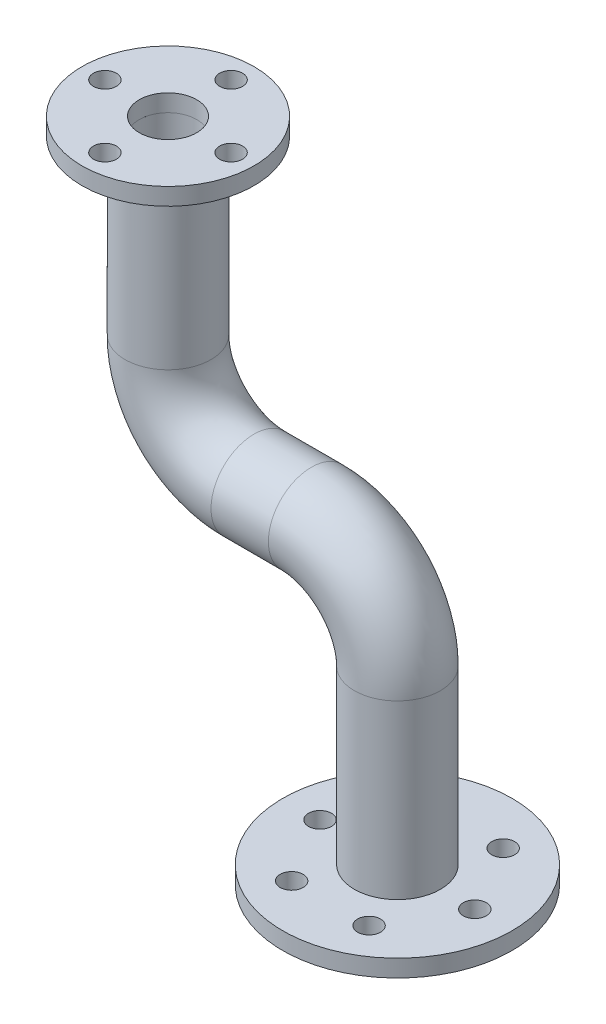
ISO-10303-21;
HEADER;
FILE_DESCRIPTION(('STEP AP214'),'2;1');
FILE_NAME('part.step','',(''),(''),'','','');
FILE_SCHEMA(('AUTOMOTIVE_DESIGN { 1 0 10303 214 1 1 1 1 }'));
ENDSEC;
DATA;
#1=APPLICATION_CONTEXT('core data for automotive mechanical design processes');
#2=APPLICATION_PROTOCOL_DEFINITION('international standard','automotive_design',2000,#1);
#3=PRODUCT_CONTEXT('',#1,'mechanical');
#4=PRODUCT('Part','Part','',(#3));
#5=PRODUCT_RELATED_PRODUCT_CATEGORY('part','',(#4));
#6=PRODUCT_DEFINITION_FORMATION('','',#4);
#7=PRODUCT_DEFINITION_CONTEXT('part definition',#1,'design');
#8=PRODUCT_DEFINITION('design','',#6,#7);
#9=PRODUCT_DEFINITION_SHAPE('','',#8);
#10=(LENGTH_UNIT() NAMED_UNIT(*) SI_UNIT(.MILLI.,.METRE.));
#11=(NAMED_UNIT(*) PLANE_ANGLE_UNIT() SI_UNIT($,.RADIAN.));
#12=(NAMED_UNIT(*) SI_UNIT($,.STERADIAN.) SOLID_ANGLE_UNIT());
#13=UNCERTAINTY_MEASURE_WITH_UNIT(LENGTH_MEASURE(1.E-05),#10,'distance_accuracy_value','');
#14=(GEOMETRIC_REPRESENTATION_CONTEXT(3) GLOBAL_UNCERTAINTY_ASSIGNED_CONTEXT((#13)) GLOBAL_UNIT_ASSIGNED_CONTEXT((#10,
#11,#12)) REPRESENTATION_CONTEXT('',''));
#15=CARTESIAN_POINT('',(0.,0.,0.));
#16=DIRECTION('',(0.,0.,1.));
#17=DIRECTION('',(1.,0.,0.));
#18=AXIS2_PLACEMENT_3D('',#15,#16,#17);
#19=CARTESIAN_POINT('',(100.,-240.,0.));
#20=DIRECTION('',(0.,-1.,0.));
#21=DIRECTION('',(0.,0.,-1.));
#22=AXIS2_PLACEMENT_3D('',#19,#20,#21);
#23=PLANE('',#22);
#24=CARTESIAN_POINT('',(66.2499999999993,-240.,58.4567147554493));
#25=DIRECTION('',(0.,-1.,0.));
#26=DIRECTION('',(-0.866025403784433,0.,-0.50000000000001));
#27=AXIS2_PLACEMENT_3D('',#24,#25,#26);
#28=CIRCLE('',#27,10.);
#29=CARTESIAN_POINT('',(57.5897459621549,-240.,53.4567147554492));
#30=VERTEX_POINT('',#29);
#31=EDGE_CURVE('E99',#30,#30,#28,.T.);
#32=ORIENTED_EDGE('',*,*,#31,.F.);
#33=EDGE_LOOP('',(#32));
#34=FACE_BOUND('',#33,.T.);
#35=CARTESIAN_POINT('',(133.749999999999,-240.,58.45671475545));
#36=DIRECTION('',(0.,-1.,0.));
#37=DIRECTION('',(-0.866025403784443,0.,0.499999999999992));
#38=AXIS2_PLACEMENT_3D('',#35,#36,#37);
#39=CIRCLE('',#38,10.);
#40=CARTESIAN_POINT('',(125.089745962155,-240.,63.4567147554499));
#41=VERTEX_POINT('',#40);
#42=EDGE_CURVE('E105',#41,#41,#39,.T.);
#43=ORIENTED_EDGE('',*,*,#42,.F.);
#44=EDGE_LOOP('',(#43));
#45=FACE_BOUND('',#44,.T.);
#46=CARTESIAN_POINT('',(167.5,-240.,0.));
#47=DIRECTION('',(0.,-1.,0.));
#48=DIRECTION('',(0.,0.,1.));
#49=AXIS2_PLACEMENT_3D('',#46,#47,#48);
#50=CIRCLE('',#49,10.);
#51=CARTESIAN_POINT('',(167.5,-240.,10.));
#52=VERTEX_POINT('',#51);
#53=EDGE_CURVE('E111',#52,#52,#50,.T.);
#54=ORIENTED_EDGE('',*,*,#53,.F.);
#55=EDGE_LOOP('',(#54));
#56=FACE_BOUND('',#55,.T.);
#57=CARTESIAN_POINT('',(133.75,-240.,-58.4567147554495));
#58=DIRECTION('',(0.,-1.,0.));
#59=DIRECTION('',(0.866025403784436,0.,0.500000000000004));
#60=AXIS2_PLACEMENT_3D('',#57,#58,#59);
#61=CIRCLE('',#60,10.);
#62=CARTESIAN_POINT('',(142.410254037845,-240.,-53.4567147554495));
#63=VERTEX_POINT('',#62);
#64=EDGE_CURVE('E117',#63,#63,#61,.T.);
#65=ORIENTED_EDGE('',*,*,#64,.F.);
#66=EDGE_LOOP('',(#65));
#67=FACE_BOUND('',#66,.T.);
#68=CARTESIAN_POINT('',(66.2500000000001,-240.,-58.4567147554497));
#69=DIRECTION('',(0.,-1.,0.));
#70=DIRECTION('',(0.86602540378444,0.,-0.499999999999998));
#71=AXIS2_PLACEMENT_3D('',#68,#69,#70);
#72=CIRCLE('',#71,10.);
#73=CARTESIAN_POINT('',(74.9102540378445,-240.,-63.4567147554497));
#74=VERTEX_POINT('',#73);
#75=EDGE_CURVE('E93',#74,#74,#72,.T.);
#76=ORIENTED_EDGE('',*,*,#75,.F.);
#77=EDGE_LOOP('',(#76));
#78=FACE_BOUND('',#77,.T.);
#79=CARTESIAN_POINT('',(32.4999999999999,-240.,0.));
#80=DIRECTION('',(0.,-1.,0.));
#81=DIRECTION('',(0.,0.,-1.));
#82=AXIS2_PLACEMENT_3D('',#79,#80,#81);
#83=CIRCLE('',#82,10.);
#84=CARTESIAN_POINT('',(32.4999999999999,-240.,-10.));
#85=VERTEX_POINT('',#84);
#86=EDGE_CURVE('E87',#85,#85,#83,.T.);
#87=ORIENTED_EDGE('',*,*,#86,.F.);
#88=EDGE_LOOP('',(#87));
#89=FACE_BOUND('',#88,.T.);
#90=CARTESIAN_POINT('',(100.,-240.,0.));
#91=DIRECTION('',(0.,-1.,0.));
#92=DIRECTION('',(0.,0.,-1.));
#93=AXIS2_PLACEMENT_3D('',#90,#91,#92);
#94=CIRCLE('',#93,100.);
#95=CARTESIAN_POINT('',(100.,-240.,-100.));
#96=VERTEX_POINT('',#95);
#97=EDGE_CURVE('E12',#96,#96,#94,.T.);
#98=ORIENTED_EDGE('',*,*,#97,.T.);
#99=EDGE_LOOP('',(#98));
#100=FACE_BOUND('',#99,.T.);
#101=CARTESIAN_POINT('',(100.,-240.,0.));
#102=DIRECTION('',(0.,-1.,0.));
#103=DIRECTION('',(0.,0.,-1.));
#104=AXIS2_PLACEMENT_3D('',#101,#102,#103);
#105=CIRCLE('',#104,25.);
#106=CARTESIAN_POINT('',(100.,-240.,-25.));
#107=VERTEX_POINT('',#106);
#108=EDGE_CURVE('E79',#107,#107,#105,.T.);
#109=ORIENTED_EDGE('',*,*,#108,.F.);
#110=EDGE_LOOP('',(#109));
#111=FACE_BOUND('',#110,.T.);
#112=ADVANCED_FACE('F68',(#34,#45,#56,#67,#78,#89,#100,#111),#23,.T.);
#113=CARTESIAN_POINT('',(100.,-225.,0.));
#114=DIRECTION('',(0.,-1.,0.));
#115=DIRECTION('',(0.,0.,-1.));
#116=AXIS2_PLACEMENT_3D('',#113,#114,#115);
#117=PLANE('',#116);
#118=CARTESIAN_POINT('',(66.2499999999993,-225.,58.4567147554493));
#119=DIRECTION('',(0.,-1.,0.));
#120=DIRECTION('',(-0.866025403784433,0.,-0.50000000000001));
#121=AXIS2_PLACEMENT_3D('',#118,#119,#120);
#122=CIRCLE('',#121,10.);
#123=CARTESIAN_POINT('',(57.5897459621549,-225.,53.4567147554492));
#124=VERTEX_POINT('',#123);
#125=EDGE_CURVE('E102',#124,#124,#122,.T.);
#126=ORIENTED_EDGE('',*,*,#125,.T.);
#127=EDGE_LOOP('',(#126));
#128=FACE_BOUND('',#127,.T.);
#129=CARTESIAN_POINT('',(133.749999999999,-225.,58.45671475545));
#130=DIRECTION('',(0.,-1.,0.));
#131=DIRECTION('',(-0.866025403784443,0.,0.499999999999992));
#132=AXIS2_PLACEMENT_3D('',#129,#130,#131);
#133=CIRCLE('',#132,10.);
#134=CARTESIAN_POINT('',(125.089745962155,-225.,63.4567147554499));
#135=VERTEX_POINT('',#134);
#136=EDGE_CURVE('E108',#135,#135,#133,.T.);
#137=ORIENTED_EDGE('',*,*,#136,.T.);
#138=EDGE_LOOP('',(#137));
#139=FACE_BOUND('',#138,.T.);
#140=CARTESIAN_POINT('',(167.5,-225.,0.));
#141=DIRECTION('',(0.,-1.,0.));
#142=DIRECTION('',(0.,0.,1.));
#143=AXIS2_PLACEMENT_3D('',#140,#141,#142);
#144=CIRCLE('',#143,10.);
#145=CARTESIAN_POINT('',(167.5,-225.,10.));
#146=VERTEX_POINT('',#145);
#147=EDGE_CURVE('E114',#146,#146,#144,.T.);
#148=ORIENTED_EDGE('',*,*,#147,.T.);
#149=EDGE_LOOP('',(#148));
#150=FACE_BOUND('',#149,.T.);
#151=CARTESIAN_POINT('',(133.75,-225.,-58.4567147554495));
#152=DIRECTION('',(0.,-1.,0.));
#153=DIRECTION('',(0.866025403784436,0.,0.500000000000004));
#154=AXIS2_PLACEMENT_3D('',#151,#152,#153);
#155=CIRCLE('',#154,10.);
#156=CARTESIAN_POINT('',(142.410254037845,-225.,-53.4567147554495));
#157=VERTEX_POINT('',#156);
#158=EDGE_CURVE('E96',#157,#157,#155,.T.);
#159=ORIENTED_EDGE('',*,*,#158,.T.);
#160=EDGE_LOOP('',(#159));
#161=FACE_BOUND('',#160,.T.);
#162=CARTESIAN_POINT('',(66.2500000000001,-225.,-58.4567147554497));
#163=DIRECTION('',(0.,-1.,0.));
#164=DIRECTION('',(0.86602540378444,0.,-0.499999999999998));
#165=AXIS2_PLACEMENT_3D('',#162,#163,#164);
#166=CIRCLE('',#165,10.);
#167=CARTESIAN_POINT('',(74.9102540378445,-225.,-63.4567147554497));
#168=VERTEX_POINT('',#167);
#169=EDGE_CURVE('E90',#168,#168,#166,.T.);
#170=ORIENTED_EDGE('',*,*,#169,.T.);
#171=EDGE_LOOP('',(#170));
#172=FACE_BOUND('',#171,.T.);
#173=CARTESIAN_POINT('',(32.4999999999999,-225.,0.));
#174=DIRECTION('',(0.,-1.,0.));
#175=DIRECTION('',(0.,0.,-1.));
#176=AXIS2_PLACEMENT_3D('',#173,#174,#175);
#177=CIRCLE('',#176,10.);
#178=CARTESIAN_POINT('',(32.4999999999999,-225.,-10.));
#179=VERTEX_POINT('',#178);
#180=EDGE_CURVE('E84',#179,#179,#177,.T.);
#181=ORIENTED_EDGE('',*,*,#180,.T.);
#182=EDGE_LOOP('',(#181));
#183=FACE_BOUND('',#182,.T.);
#184=CARTESIAN_POINT('',(100.,-225.,0.));
#185=DIRECTION('',(0.,-1.,0.));
#186=DIRECTION('',(0.,0.,-1.));
#187=AXIS2_PLACEMENT_3D('',#184,#185,#186);
#188=CIRCLE('',#187,100.);
#189=CARTESIAN_POINT('',(100.,-225.,-100.));
#190=VERTEX_POINT('',#189);
#191=EDGE_CURVE('E72',#190,#190,#188,.T.);
#192=ORIENTED_EDGE('',*,*,#191,.F.);
#193=EDGE_LOOP('',(#192));
#194=FACE_BOUND('',#193,.T.);
#195=CARTESIAN_POINT('',(100.,-225.,0.));
#196=DIRECTION('',(0.,-1.,0.));
#197=DIRECTION('',(0.,0.,-1.));
#198=AXIS2_PLACEMENT_3D('',#195,#196,#197);
#199=CIRCLE('',#198,25.);
#200=CARTESIAN_POINT('',(100.,-225.,-25.));
#201=VERTEX_POINT('',#200);
#202=EDGE_CURVE('E81',#201,#201,#199,.T.);
#203=ORIENTED_EDGE('',*,*,#202,.T.);
#204=EDGE_LOOP('',(#203));
#205=FACE_BOUND('',#204,.T.);
#206=ADVANCED_FACE('F123',(#128,#139,#150,#161,#172,#183,#194,#205),#117,.F.);
#207=CARTESIAN_POINT('',(100.,-240.,0.));
#208=DIRECTION('',(0.,1.,0.));
#209=DIRECTION('',(0.,0.,1.));
#210=AXIS2_PLACEMENT_3D('',#207,#208,#209);
#211=CYLINDRICAL_SURFACE('',#210,100.);
#212=ORIENTED_EDGE('',*,*,#97,.F.);
#213=EDGE_LOOP('',(#212));
#214=FACE_BOUND('',#213,.T.);
#215=ORIENTED_EDGE('',*,*,#191,.T.);
#216=EDGE_LOOP('',(#215));
#217=FACE_BOUND('',#216,.T.);
#218=ADVANCED_FACE('F70',(#214,#217),#211,.T.);
#219=CARTESIAN_POINT('',(100.,-240.,0.));
#220=DIRECTION('',(0.,1.,0.));
#221=DIRECTION('',(0.,0.,1.));
#222=AXIS2_PLACEMENT_3D('',#219,#220,#221);
#223=CYLINDRICAL_SURFACE('',#222,25.);
#224=ORIENTED_EDGE('',*,*,#108,.T.);
#225=EDGE_LOOP('',(#224));
#226=FACE_BOUND('',#225,.T.);
#227=ORIENTED_EDGE('',*,*,#202,.F.);
#228=EDGE_LOOP('',(#227));
#229=FACE_BOUND('',#228,.T.);
#230=ADVANCED_FACE('F144',(#226,#229),#223,.F.);
#231=CARTESIAN_POINT('',(32.4999999999999,-225.,0.));
#232=DIRECTION('',(0.,-1.,0.));
#233=DIRECTION('',(0.,0.,-1.));
#234=AXIS2_PLACEMENT_3D('',#231,#232,#233);
#235=CYLINDRICAL_SURFACE('',#234,10.);
#236=ORIENTED_EDGE('',*,*,#180,.F.);
#237=EDGE_LOOP('',(#236));
#238=FACE_BOUND('',#237,.T.);
#239=ORIENTED_EDGE('',*,*,#86,.T.);
#240=EDGE_LOOP('',(#239));
#241=FACE_BOUND('',#240,.T.);
#242=ADVANCED_FACE('F147',(#238,#241),#235,.F.);
#243=CARTESIAN_POINT('',(66.2500000000001,-225.,-58.4567147554497));
#244=DIRECTION('',(0.,-1.,0.));
#245=DIRECTION('',(0.,0.,-1.));
#246=AXIS2_PLACEMENT_3D('',#243,#244,#245);
#247=CYLINDRICAL_SURFACE('',#246,10.);
#248=ORIENTED_EDGE('',*,*,#169,.F.);
#249=EDGE_LOOP('',(#248));
#250=FACE_BOUND('',#249,.T.);
#251=ORIENTED_EDGE('',*,*,#75,.T.);
#252=EDGE_LOOP('',(#251));
#253=FACE_BOUND('',#252,.T.);
#254=ADVANCED_FACE('F130',(#250,#253),#247,.F.);
#255=CARTESIAN_POINT('',(133.75,-225.,-58.4567147554495));
#256=DIRECTION('',(0.,-1.,0.));
#257=DIRECTION('',(0.,0.,-1.));
#258=AXIS2_PLACEMENT_3D('',#255,#256,#257);
#259=CYLINDRICAL_SURFACE('',#258,10.);
#260=ORIENTED_EDGE('',*,*,#158,.F.);
#261=EDGE_LOOP('',(#260));
#262=FACE_BOUND('',#261,.T.);
#263=ORIENTED_EDGE('',*,*,#64,.T.);
#264=EDGE_LOOP('',(#263));
#265=FACE_BOUND('',#264,.T.);
#266=ADVANCED_FACE('F126',(#262,#265),#259,.F.);
#267=CARTESIAN_POINT('',(167.5,-225.,0.));
#268=DIRECTION('',(0.,-1.,0.));
#269=DIRECTION('',(0.,0.,-1.));
#270=AXIS2_PLACEMENT_3D('',#267,#268,#269);
#271=CYLINDRICAL_SURFACE('',#270,10.);
#272=ORIENTED_EDGE('',*,*,#147,.F.);
#273=EDGE_LOOP('',(#272));
#274=FACE_BOUND('',#273,.T.);
#275=ORIENTED_EDGE('',*,*,#53,.T.);
#276=EDGE_LOOP('',(#275));
#277=FACE_BOUND('',#276,.T.);
#278=ADVANCED_FACE('F129',(#274,#277),#271,.F.);
#279=CARTESIAN_POINT('',(133.749999999999,-225.,58.45671475545));
#280=DIRECTION('',(0.,-1.,0.));
#281=DIRECTION('',(0.,0.,-1.));
#282=AXIS2_PLACEMENT_3D('',#279,#280,#281);
#283=CYLINDRICAL_SURFACE('',#282,10.);
#284=ORIENTED_EDGE('',*,*,#136,.F.);
#285=EDGE_LOOP('',(#284));
#286=FACE_BOUND('',#285,.T.);
#287=ORIENTED_EDGE('',*,*,#42,.T.);
#288=EDGE_LOOP('',(#287));
#289=FACE_BOUND('',#288,.T.);
#290=ADVANCED_FACE('F168',(#286,#289),#283,.F.);
#291=CARTESIAN_POINT('',(66.2499999999993,-225.,58.4567147554493));
#292=DIRECTION('',(0.,-1.,0.));
#293=DIRECTION('',(0.,0.,-1.));
#294=AXIS2_PLACEMENT_3D('',#291,#292,#293);
#295=CYLINDRICAL_SURFACE('',#294,10.);
#296=ORIENTED_EDGE('',*,*,#125,.F.);
#297=EDGE_LOOP('',(#296));
#298=FACE_BOUND('',#297,.T.);
#299=ORIENTED_EDGE('',*,*,#31,.T.);
#300=EDGE_LOOP('',(#299));
#301=FACE_BOUND('',#300,.T.);
#302=ADVANCED_FACE('F165',(#298,#301),#295,.F.);
#303=CLOSED_SHELL('',(#112,#206,#218,#230,#242,#254,#266,#278,#290,#302));
#304=MANIFOLD_SOLID_BREP('B2',#303);
#305=CARTESIAN_POINT('',(-100.,240.,0.));
#306=DIRECTION('',(0.,1.,0.));
#307=DIRECTION('',(0.,0.,1.));
#308=AXIS2_PLACEMENT_3D('',#305,#306,#307);
#309=PLANE('',#308);
#310=CARTESIAN_POINT('',(-100.,240.,55.));
#311=DIRECTION('',(0.,1.,0.));
#312=DIRECTION('',(-1.,0.,0.));
#313=AXIS2_PLACEMENT_3D('',#310,#311,#312);
#314=CIRCLE('',#313,10.);
#315=CARTESIAN_POINT('',(-110.,240.,54.9999999999999));
#316=VERTEX_POINT('',#315);
#317=EDGE_CURVE('E300',#316,#316,#314,.T.);
#318=ORIENTED_EDGE('',*,*,#317,.F.);
#319=EDGE_LOOP('',(#318));
#320=FACE_BOUND('',#319,.T.);
#321=CARTESIAN_POINT('',(-155.,240.,0.));
#322=DIRECTION('',(0.,1.,0.));
#323=DIRECTION('',(0.,0.,-1.));
#324=AXIS2_PLACEMENT_3D('',#321,#322,#323);
#325=CIRCLE('',#324,10.);
#326=CARTESIAN_POINT('',(-155.,240.,-10.));
#327=VERTEX_POINT('',#326);
#328=EDGE_CURVE('E294',#327,#327,#325,.T.);
#329=ORIENTED_EDGE('',*,*,#328,.F.);
#330=EDGE_LOOP('',(#329));
#331=FACE_BOUND('',#330,.T.);
#332=CARTESIAN_POINT('',(-99.9999999999994,240.,-55.));
#333=DIRECTION('',(0.,1.,0.));
#334=DIRECTION('',(1.,0.,0.));
#335=AXIS2_PLACEMENT_3D('',#332,#333,#334);
#336=CIRCLE('',#335,10.);
#337=CARTESIAN_POINT('',(-89.9999999999994,240.,-54.9999999999999));
#338=VERTEX_POINT('',#337);
#339=EDGE_CURVE('E288',#338,#338,#336,.T.);
#340=ORIENTED_EDGE('',*,*,#339,.F.);
#341=EDGE_LOOP('',(#340));
#342=FACE_BOUND('',#341,.T.);
#343=CARTESIAN_POINT('',(-45.,240.,0.));
#344=DIRECTION('',(0.,1.,0.));
#345=DIRECTION('',(0.,0.,1.));
#346=AXIS2_PLACEMENT_3D('',#343,#344,#345);
#347=CIRCLE('',#346,10.);
#348=CARTESIAN_POINT('',(-45.,240.,10.));
#349=VERTEX_POINT('',#348);
#350=EDGE_CURVE('E282',#349,#349,#347,.T.);
#351=ORIENTED_EDGE('',*,*,#350,.F.);
#352=EDGE_LOOP('',(#351));
#353=FACE_BOUND('',#352,.T.);
#354=CARTESIAN_POINT('',(-100.,240.,0.));
#355=DIRECTION('',(0.,1.,0.));
#356=DIRECTION('',(0.,0.,1.));
#357=AXIS2_PLACEMENT_3D('',#354,#355,#356);
#358=CIRCLE('',#357,75.);
#359=CARTESIAN_POINT('',(-100.,240.,75.));
#360=VERTEX_POINT('',#359);
#361=EDGE_CURVE('E67',#360,#360,#358,.T.);
#362=ORIENTED_EDGE('',*,*,#361,.T.);
#363=EDGE_LOOP('',(#362));
#364=FACE_BOUND('',#363,.T.);
#365=CARTESIAN_POINT('',(-100.,240.,0.));
#366=DIRECTION('',(0.,1.,0.));
#367=DIRECTION('',(0.,0.,1.));
#368=AXIS2_PLACEMENT_3D('',#365,#366,#367);
#369=CIRCLE('',#368,25.);
#370=CARTESIAN_POINT('',(-100.,240.,25.));
#371=VERTEX_POINT('',#370);
#372=EDGE_CURVE('E274',#371,#371,#369,.T.);
#373=ORIENTED_EDGE('',*,*,#372,.F.);
#374=EDGE_LOOP('',(#373));
#375=FACE_BOUND('',#374,.T.);
#376=ADVANCED_FACE('F263',(#320,#331,#342,#353,#364,#375),#309,.T.);
#377=CARTESIAN_POINT('',(-100.,225.,0.));
#378=DIRECTION('',(0.,1.,0.));
#379=DIRECTION('',(0.,0.,1.));
#380=AXIS2_PLACEMENT_3D('',#377,#378,#379);
#381=PLANE('',#380);
#382=CARTESIAN_POINT('',(-100.,225.,55.));
#383=DIRECTION('',(0.,1.,0.));
#384=DIRECTION('',(-1.,0.,0.));
#385=AXIS2_PLACEMENT_3D('',#382,#383,#384);
#386=CIRCLE('',#385,10.);
#387=CARTESIAN_POINT('',(-110.,225.,54.9999999999999));
#388=VERTEX_POINT('',#387);
#389=EDGE_CURVE('E285',#388,#388,#386,.T.);
#390=ORIENTED_EDGE('',*,*,#389,.T.);
#391=EDGE_LOOP('',(#390));
#392=FACE_BOUND('',#391,.T.);
#393=CARTESIAN_POINT('',(-155.,225.,0.));
#394=DIRECTION('',(0.,1.,0.));
#395=DIRECTION('',(0.,0.,-1.));
#396=AXIS2_PLACEMENT_3D('',#393,#394,#395);
#397=CIRCLE('',#396,10.);
#398=CARTESIAN_POINT('',(-155.,225.,-10.));
#399=VERTEX_POINT('',#398);
#400=EDGE_CURVE('E297',#399,#399,#397,.T.);
#401=ORIENTED_EDGE('',*,*,#400,.T.);
#402=EDGE_LOOP('',(#401));
#403=FACE_BOUND('',#402,.T.);
#404=CARTESIAN_POINT('',(-99.9999999999994,225.,-55.));
#405=DIRECTION('',(0.,1.,0.));
#406=DIRECTION('',(1.,0.,0.));
#407=AXIS2_PLACEMENT_3D('',#404,#405,#406);
#408=CIRCLE('',#407,10.);
#409=CARTESIAN_POINT('',(-89.9999999999994,225.,-54.9999999999999));
#410=VERTEX_POINT('',#409);
#411=EDGE_CURVE('E291',#410,#410,#408,.T.);
#412=ORIENTED_EDGE('',*,*,#411,.T.);
#413=EDGE_LOOP('',(#412));
#414=FACE_BOUND('',#413,.T.);
#415=CARTESIAN_POINT('',(-45.,225.,0.));
#416=DIRECTION('',(0.,1.,0.));
#417=DIRECTION('',(0.,0.,1.));
#418=AXIS2_PLACEMENT_3D('',#415,#416,#417);
#419=CIRCLE('',#418,10.);
#420=CARTESIAN_POINT('',(-45.,225.,10.));
#421=VERTEX_POINT('',#420);
#422=EDGE_CURVE('E279',#421,#421,#419,.T.);
#423=ORIENTED_EDGE('',*,*,#422,.T.);
#424=EDGE_LOOP('',(#423));
#425=FACE_BOUND('',#424,.T.);
#426=CARTESIAN_POINT('',(-100.,225.,0.));
#427=DIRECTION('',(0.,1.,0.));
#428=DIRECTION('',(0.,0.,1.));
#429=AXIS2_PLACEMENT_3D('',#426,#427,#428);
#430=CIRCLE('',#429,75.);
#431=CARTESIAN_POINT('',(-100.,225.,75.));
#432=VERTEX_POINT('',#431);
#433=EDGE_CURVE('E267',#432,#432,#430,.T.);
#434=ORIENTED_EDGE('',*,*,#433,.F.);
#435=EDGE_LOOP('',(#434));
#436=FACE_BOUND('',#435,.T.);
#437=CARTESIAN_POINT('',(-100.,225.,0.));
#438=DIRECTION('',(0.,1.,0.));
#439=DIRECTION('',(0.,0.,1.));
#440=AXIS2_PLACEMENT_3D('',#437,#438,#439);
#441=CIRCLE('',#440,25.);
#442=CARTESIAN_POINT('',(-100.,225.,25.));
#443=VERTEX_POINT('',#442);
#444=EDGE_CURVE('E276',#443,#443,#441,.T.);
#445=ORIENTED_EDGE('',*,*,#444,.T.);
#446=EDGE_LOOP('',(#445));
#447=FACE_BOUND('',#446,.T.);
#448=ADVANCED_FACE('F306',(#392,#403,#414,#425,#436,#447),#381,.F.);
#449=CARTESIAN_POINT('',(-100.,240.,0.));
#450=DIRECTION('',(0.,-1.,0.));
#451=DIRECTION('',(0.,0.,-1.));
#452=AXIS2_PLACEMENT_3D('',#449,#450,#451);
#453=CYLINDRICAL_SURFACE('',#452,75.);
#454=ORIENTED_EDGE('',*,*,#361,.F.);
#455=EDGE_LOOP('',(#454));
#456=FACE_BOUND('',#455,.T.);
#457=ORIENTED_EDGE('',*,*,#433,.T.);
#458=EDGE_LOOP('',(#457));
#459=FACE_BOUND('',#458,.T.);
#460=ADVANCED_FACE('F265',(#456,#459),#453,.T.);
#461=CARTESIAN_POINT('',(-100.,240.,0.));
#462=DIRECTION('',(0.,-1.,0.));
#463=DIRECTION('',(0.,0.,-1.));
#464=AXIS2_PLACEMENT_3D('',#461,#462,#463);
#465=CYLINDRICAL_SURFACE('',#464,25.);
#466=ORIENTED_EDGE('',*,*,#372,.T.);
#467=EDGE_LOOP('',(#466));
#468=FACE_BOUND('',#467,.T.);
#469=ORIENTED_EDGE('',*,*,#444,.F.);
#470=EDGE_LOOP('',(#469));
#471=FACE_BOUND('',#470,.T.);
#472=ADVANCED_FACE('F327',(#468,#471),#465,.F.);
#473=CARTESIAN_POINT('',(-45.,225.,0.));
#474=DIRECTION('',(0.,1.,0.));
#475=DIRECTION('',(0.,0.,1.));
#476=AXIS2_PLACEMENT_3D('',#473,#474,#475);
#477=CYLINDRICAL_SURFACE('',#476,10.);
#478=ORIENTED_EDGE('',*,*,#422,.F.);
#479=EDGE_LOOP('',(#478));
#480=FACE_BOUND('',#479,.T.);
#481=ORIENTED_EDGE('',*,*,#350,.T.);
#482=EDGE_LOOP('',(#481));
#483=FACE_BOUND('',#482,.T.);
#484=ADVANCED_FACE('F330',(#480,#483),#477,.F.);
#485=CARTESIAN_POINT('',(-99.9999999999994,225.,-55.));
#486=DIRECTION('',(0.,1.,0.));
#487=DIRECTION('',(0.,0.,1.));
#488=AXIS2_PLACEMENT_3D('',#485,#486,#487);
#489=CYLINDRICAL_SURFACE('',#488,10.);
#490=ORIENTED_EDGE('',*,*,#411,.F.);
#491=EDGE_LOOP('',(#490));
#492=FACE_BOUND('',#491,.T.);
#493=ORIENTED_EDGE('',*,*,#339,.T.);
#494=EDGE_LOOP('',(#493));
#495=FACE_BOUND('',#494,.T.);
#496=ADVANCED_FACE('F342',(#492,#495),#489,.F.);
#497=CARTESIAN_POINT('',(-155.,225.,0.));
#498=DIRECTION('',(0.,1.,0.));
#499=DIRECTION('',(0.,0.,1.));
#500=AXIS2_PLACEMENT_3D('',#497,#498,#499);
#501=CYLINDRICAL_SURFACE('',#500,10.);
#502=ORIENTED_EDGE('',*,*,#400,.F.);
#503=EDGE_LOOP('',(#502));
#504=FACE_BOUND('',#503,.T.);
#505=ORIENTED_EDGE('',*,*,#328,.T.);
#506=EDGE_LOOP('',(#505));
#507=FACE_BOUND('',#506,.T.);
#508=ADVANCED_FACE('F312',(#504,#507),#501,.F.);
#509=CARTESIAN_POINT('',(-100.,225.,55.));
#510=DIRECTION('',(0.,1.,0.));
#511=DIRECTION('',(0.,0.,1.));
#512=AXIS2_PLACEMENT_3D('',#509,#510,#511);
#513=CYLINDRICAL_SURFACE('',#512,10.);
#514=ORIENTED_EDGE('',*,*,#389,.F.);
#515=EDGE_LOOP('',(#514));
#516=FACE_BOUND('',#515,.T.);
#517=ORIENTED_EDGE('',*,*,#317,.T.);
#518=EDGE_LOOP('',(#517));
#519=FACE_BOUND('',#518,.T.);
#520=ADVANCED_FACE('F309',(#516,#519),#513,.F.);
#521=CLOSED_SHELL('',(#376,#448,#460,#472,#484,#496,#508,#520));
#522=MANIFOLD_SOLID_BREP('B7',#521);
#523=CARTESIAN_POINT('',(-100.,225.,0.));
#524=DIRECTION('',(0.,1.,0.));
#525=DIRECTION('',(0.,0.,1.));
#526=AXIS2_PLACEMENT_3D('',#523,#524,#525);
#527=PLANE('',#526);
#528=CARTESIAN_POINT('',(-100.,225.,0.));
#529=DIRECTION('',(0.,1.,0.));
#530=DIRECTION('',(0.,0.,1.));
#531=AXIS2_PLACEMENT_3D('',#528,#529,#530);
#532=CIRCLE('',#531,25.);
#533=CARTESIAN_POINT('',(-100.,225.,25.));
#534=VERTEX_POINT('',#533);
#535=EDGE_CURVE('E434',#534,#534,#532,.T.);
#536=ORIENTED_EDGE('',*,*,#535,.F.);
#537=EDGE_LOOP('',(#536));
#538=FACE_BOUND('',#537,.T.);
#539=CARTESIAN_POINT('',(-100.,225.,0.));
#540=DIRECTION('',(0.,1.,0.));
#541=DIRECTION('',(0.,0.,1.));
#542=AXIS2_PLACEMENT_3D('',#539,#540,#541);
#543=CIRCLE('',#542,37.5);
#544=CARTESIAN_POINT('',(-100.,225.,37.5));
#545=VERTEX_POINT('',#544);
#546=EDGE_CURVE('E431',#545,#545,#543,.T.);
#547=ORIENTED_EDGE('',*,*,#546,.T.);
#548=EDGE_LOOP('',(#547));
#549=FACE_BOUND('',#548,.T.);
#550=ADVANCED_FACE('F409',(#538,#549),#527,.T.);
#551=CARTESIAN_POINT('',(100.,-225.,0.));
#552=DIRECTION('',(0.,1.,0.));
#553=DIRECTION('',(0.,0.,1.));
#554=AXIS2_PLACEMENT_3D('',#551,#552,#553);
#555=PLANE('',#554);
#556=CARTESIAN_POINT('',(100.,-225.,0.));
#557=DIRECTION('',(0.,1.,0.));
#558=DIRECTION('',(0.,0.,1.));
#559=AXIS2_PLACEMENT_3D('',#556,#557,#558);
#560=CIRCLE('',#559,25.);
#561=CARTESIAN_POINT('',(100.,-225.,25.));
#562=VERTEX_POINT('',#561);
#563=EDGE_CURVE('E437',#562,#562,#560,.T.);
#564=ORIENTED_EDGE('',*,*,#563,.T.);
#565=EDGE_LOOP('',(#564));
#566=FACE_BOUND('',#565,.T.);
#567=CARTESIAN_POINT('',(100.,-225.,0.));
#568=DIRECTION('',(0.,1.,0.));
#569=DIRECTION('',(0.,0.,1.));
#570=AXIS2_PLACEMENT_3D('',#567,#568,#569);
#571=CIRCLE('',#570,37.5);
#572=CARTESIAN_POINT('',(100.,-225.,37.5));
#573=VERTEX_POINT('',#572);
#574=EDGE_CURVE('E262',#573,#573,#571,.T.);
#575=ORIENTED_EDGE('',*,*,#574,.F.);
#576=EDGE_LOOP('',(#575));
#577=FACE_BOUND('',#576,.T.);
#578=ADVANCED_FACE('F453',(#566,#577),#555,.F.);
#579=CARTESIAN_POINT('',(-100.,225.,0.));
#580=DIRECTION('',(0.,-1.,0.));
#581=DIRECTION('',(0.,0.,-1.));
#582=AXIS2_PLACEMENT_3D('',#579,#580,#581);
#583=CYLINDRICAL_SURFACE('',#582,37.5);
#584=CARTESIAN_POINT('',(-100.,75.,0.));
#585=DIRECTION('',(0.,1.,0.));
#586=DIRECTION('',(0.,0.,1.));
#587=AXIS2_PLACEMENT_3D('',#584,#585,#586);
#588=CIRCLE('',#587,37.5);
#589=CARTESIAN_POINT('',(-137.5,75.,0.));
#590=VERTEX_POINT('',#589);
#591=EDGE_CURVE('E428',#590,#590,#588,.T.);
#592=ORIENTED_EDGE('',*,*,#591,.T.);
#593=EDGE_LOOP('',(#592));
#594=FACE_BOUND('',#593,.T.);
#595=ORIENTED_EDGE('',*,*,#546,.F.);
#596=EDGE_LOOP('',(#595));
#597=FACE_BOUND('',#596,.T.);
#598=ADVANCED_FACE('F491',(#594,#597),#583,.T.);
#599=CARTESIAN_POINT('',(-25.,75.,0.));
#600=DIRECTION('',(0.,0.,1.));
#601=DIRECTION('',(1.,0.,0.));
#602=AXIS2_PLACEMENT_3D('',#599,#600,#601);
#603=TOROIDAL_SURFACE('',#602,75.,37.5);
#604=CARTESIAN_POINT('',(-25.,0.,0.));
#605=DIRECTION('',(-1.,0.,0.));
#606=DIRECTION('',(0.,0.,1.));
#607=AXIS2_PLACEMENT_3D('',#604,#605,#606);
#608=CIRCLE('',#607,37.5);
#609=CARTESIAN_POINT('',(-25.,-37.5,0.));
#610=VERTEX_POINT('',#609);
#611=EDGE_CURVE('E423',#610,#610,#608,.T.);
#612=CARTESIAN_POINT('',(-25.,75.,0.));
#613=DIRECTION('',(0.,0.,1.));
#614=DIRECTION('',(1.,0.,0.));
#615=AXIS2_PLACEMENT_3D('',#612,#613,#614);
#616=CIRCLE('',#615,112.5);
#617=EDGE_CURVE('',#590,#610,#616,.T.);
#618=ORIENTED_EDGE('',*,*,#591,.F.);
#619=ORIENTED_EDGE('',*,*,#611,.T.);
#620=ORIENTED_EDGE('',*,*,#617,.T.);
#621=ORIENTED_EDGE('',*,*,#617,.F.);
#622=EDGE_LOOP('',(#618,#620,#619,#621));
#623=FACE_BOUND('',#622,.T.);
#624=ADVANCED_FACE('F493',(#623),#603,.T.);
#625=CARTESIAN_POINT('',(-25.,0.,0.));
#626=DIRECTION('',(1.,0.,0.));
#627=DIRECTION('',(0.,0.,-1.));
#628=AXIS2_PLACEMENT_3D('',#625,#626,#627);
#629=CYLINDRICAL_SURFACE('',#628,37.5);
#630=CARTESIAN_POINT('',(25.,0.,0.));
#631=DIRECTION('',(-1.,0.,0.));
#632=DIRECTION('',(0.,0.,1.));
#633=AXIS2_PLACEMENT_3D('',#630,#631,#632);
#634=CIRCLE('',#633,37.5);
#635=CARTESIAN_POINT('',(25.,37.5,0.));
#636=VERTEX_POINT('',#635);
#637=EDGE_CURVE('E419',#636,#636,#634,.T.);
#638=ORIENTED_EDGE('',*,*,#637,.T.);
#639=EDGE_LOOP('',(#638));
#640=FACE_BOUND('',#639,.T.);
#641=ORIENTED_EDGE('',*,*,#611,.F.);
#642=EDGE_LOOP('',(#641));
#643=FACE_BOUND('',#642,.T.);
#644=ADVANCED_FACE('F500',(#640,#643),#629,.T.);
#645=CARTESIAN_POINT('',(25.,-75.,0.));
#646=DIRECTION('',(0.,0.,-1.));
#647=DIRECTION('',(-1.,0.,0.));
#648=AXIS2_PLACEMENT_3D('',#645,#646,#647);
#649=TOROIDAL_SURFACE('',#648,75.,37.5);
#650=CARTESIAN_POINT('',(100.,-75.,0.));
#651=DIRECTION('',(0.,1.,0.));
#652=DIRECTION('',(0.,0.,1.));
#653=AXIS2_PLACEMENT_3D('',#650,#651,#652);
#654=CIRCLE('',#653,37.5);
#655=CARTESIAN_POINT('',(137.5,-75.,0.));
#656=VERTEX_POINT('',#655);
#657=EDGE_CURVE('E415',#656,#656,#654,.T.);
#658=CARTESIAN_POINT('',(25.,-75.,0.));
#659=DIRECTION('',(0.,0.,-1.));
#660=DIRECTION('',(-1.,0.,0.));
#661=AXIS2_PLACEMENT_3D('',#658,#659,#660);
#662=CIRCLE('',#661,112.5);
#663=EDGE_CURVE('',#636,#656,#662,.T.);
#664=ORIENTED_EDGE('',*,*,#637,.F.);
#665=ORIENTED_EDGE('',*,*,#657,.T.);
#666=ORIENTED_EDGE('',*,*,#663,.T.);
#667=ORIENTED_EDGE('',*,*,#663,.F.);
#668=EDGE_LOOP('',(#664,#666,#665,#667));
#669=FACE_BOUND('',#668,.T.);
#670=ADVANCED_FACE('F504',(#669),#649,.T.);
#671=CARTESIAN_POINT('',(100.,-75.,0.));
#672=DIRECTION('',(0.,-1.,0.));
#673=DIRECTION('',(1.,0.,0.));
#674=AXIS2_PLACEMENT_3D('',#671,#672,#673);
#675=CYLINDRICAL_SURFACE('',#674,37.5);
#676=ORIENTED_EDGE('',*,*,#574,.T.);
#677=EDGE_LOOP('',(#676));
#678=FACE_BOUND('',#677,.T.);
#679=ORIENTED_EDGE('',*,*,#657,.F.);
#680=EDGE_LOOP('',(#679));
#681=FACE_BOUND('',#680,.T.);
#682=ADVANCED_FACE('F483',(#678,#681),#675,.T.);
#683=CARTESIAN_POINT('',(-100.,226.5,0.));
#684=DIRECTION('',(0.,-1.,0.));
#685=DIRECTION('',(0.,0.,-1.));
#686=AXIS2_PLACEMENT_3D('',#683,#684,#685);
#687=CYLINDRICAL_SURFACE('',#686,25.);
#688=CARTESIAN_POINT('',(-100.,75.,0.));
#689=DIRECTION('',(0.,1.,0.));
#690=DIRECTION('',(0.,0.,1.));
#691=AXIS2_PLACEMENT_3D('',#688,#689,#690);
#692=CIRCLE('',#691,25.);
#693=CARTESIAN_POINT('',(-125.,75.,0.));
#694=VERTEX_POINT('',#693);
#695=EDGE_CURVE('E438',#694,#694,#692,.T.);
#696=ORIENTED_EDGE('',*,*,#695,.F.);
#697=EDGE_LOOP('',(#696));
#698=FACE_BOUND('',#697,.T.);
#699=ORIENTED_EDGE('',*,*,#535,.T.);
#700=EDGE_LOOP('',(#699));
#701=FACE_BOUND('',#700,.T.);
#702=ADVANCED_FACE('F461',(#698,#701),#687,.F.);
#703=CARTESIAN_POINT('',(-25.,75.,0.));
#704=DIRECTION('',(0.,0.,1.));
#705=DIRECTION('',(1.,0.,0.));
#706=AXIS2_PLACEMENT_3D('',#703,#704,#705);
#707=TOROIDAL_SURFACE('',#706,75.,25.);
#708=CARTESIAN_POINT('',(-25.,0.,0.));
#709=DIRECTION('',(-1.,0.,0.));
#710=DIRECTION('',(0.,0.,1.));
#711=AXIS2_PLACEMENT_3D('',#708,#709,#710);
#712=CIRCLE('',#711,25.);
#713=CARTESIAN_POINT('',(-25.,-25.,0.));
#714=VERTEX_POINT('',#713);
#715=EDGE_CURVE('E441',#714,#714,#712,.T.);
#716=CARTESIAN_POINT('',(-25.,75.,0.));
#717=DIRECTION('',(0.,0.,1.));
#718=DIRECTION('',(1.,0.,0.));
#719=AXIS2_PLACEMENT_3D('',#716,#717,#718);
#720=CIRCLE('',#719,100.);
#721=EDGE_CURVE('',#694,#714,#720,.T.);
#722=ORIENTED_EDGE('',*,*,#695,.T.);
#723=ORIENTED_EDGE('',*,*,#715,.F.);
#724=ORIENTED_EDGE('',*,*,#721,.T.);
#725=ORIENTED_EDGE('',*,*,#721,.F.);
#726=EDGE_LOOP('',(#722,#724,#723,#725));
#727=FACE_BOUND('',#726,.T.);
#728=ADVANCED_FACE('F472',(#727),#707,.F.);
#729=CARTESIAN_POINT('',(-25.,0.,0.));
#730=DIRECTION('',(1.,0.,0.));
#731=DIRECTION('',(0.,0.,-1.));
#732=AXIS2_PLACEMENT_3D('',#729,#730,#731);
#733=CYLINDRICAL_SURFACE('',#732,25.);
#734=CARTESIAN_POINT('',(25.,0.,0.));
#735=DIRECTION('',(-1.,0.,0.));
#736=DIRECTION('',(0.,0.,1.));
#737=AXIS2_PLACEMENT_3D('',#734,#735,#736);
#738=CIRCLE('',#737,25.);
#739=CARTESIAN_POINT('',(25.,25.,0.));
#740=VERTEX_POINT('',#739);
#741=EDGE_CURVE('E444',#740,#740,#738,.T.);
#742=ORIENTED_EDGE('',*,*,#741,.F.);
#743=EDGE_LOOP('',(#742));
#744=FACE_BOUND('',#743,.T.);
#745=ORIENTED_EDGE('',*,*,#715,.T.);
#746=EDGE_LOOP('',(#745));
#747=FACE_BOUND('',#746,.T.);
#748=ADVANCED_FACE('F466',(#744,#747),#733,.F.);
#749=CARTESIAN_POINT('',(25.,-75.,0.));
#750=DIRECTION('',(0.,0.,-1.));
#751=DIRECTION('',(-1.,0.,0.));
#752=AXIS2_PLACEMENT_3D('',#749,#750,#751);
#753=TOROIDAL_SURFACE('',#752,75.,25.);
#754=CARTESIAN_POINT('',(99.9999999999999,-75.,0.));
#755=DIRECTION('',(0.,1.,0.));
#756=DIRECTION('',(0.,0.,1.));
#757=AXIS2_PLACEMENT_3D('',#754,#755,#756);
#758=CIRCLE('',#757,25.);
#759=CARTESIAN_POINT('',(125.,-75.,0.));
#760=VERTEX_POINT('',#759);
#761=EDGE_CURVE('E447',#760,#760,#758,.T.);
#762=CARTESIAN_POINT('',(25.,-75.,0.));
#763=DIRECTION('',(0.,0.,-1.));
#764=DIRECTION('',(-1.,0.,0.));
#765=AXIS2_PLACEMENT_3D('',#762,#763,#764);
#766=CIRCLE('',#765,100.);
#767=EDGE_CURVE('',#740,#760,#766,.T.);
#768=ORIENTED_EDGE('',*,*,#741,.T.);
#769=ORIENTED_EDGE('',*,*,#761,.F.);
#770=ORIENTED_EDGE('',*,*,#767,.T.);
#771=ORIENTED_EDGE('',*,*,#767,.F.);
#772=EDGE_LOOP('',(#768,#770,#769,#771));
#773=FACE_BOUND('',#772,.T.);
#774=ADVANCED_FACE('F459',(#773),#753,.F.);
#775=CARTESIAN_POINT('',(100.,-75.,0.));
#776=DIRECTION('',(0.,-1.,0.));
#777=DIRECTION('',(1.,0.,0.));
#778=AXIS2_PLACEMENT_3D('',#775,#776,#777);
#779=CYLINDRICAL_SURFACE('',#778,25.);
#780=ORIENTED_EDGE('',*,*,#563,.F.);
#781=EDGE_LOOP('',(#780));
#782=FACE_BOUND('',#781,.T.);
#783=ORIENTED_EDGE('',*,*,#761,.T.);
#784=EDGE_LOOP('',(#783));
#785=FACE_BOUND('',#784,.T.);
#786=ADVANCED_FACE('F456',(#782,#785),#779,.F.);
#787=CLOSED_SHELL('',(#550,#578,#598,#624,#644,#670,#682,#702,#728,#748,#774,#786));
#788=MANIFOLD_SOLID_BREP('B62',#787);
#789=ADVANCED_BREP_SHAPE_REPRESENTATION('',(#18,#304,#522,#788),#14);
#790=SHAPE_DEFINITION_REPRESENTATION(#9,#789);
ENDSEC;
END-ISO-10303-21;
